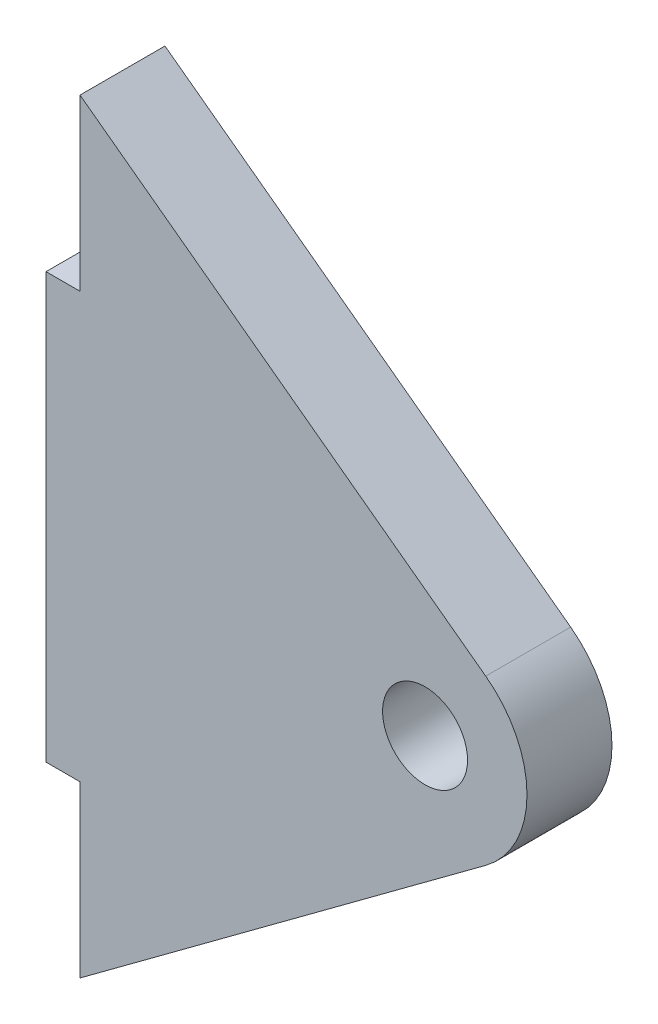
ISO-10303-21;
HEADER;
FILE_DESCRIPTION(('STEP AP214'),'2;1');
FILE_NAME('part.step','',(''),(''),'','','');
FILE_SCHEMA(('AUTOMOTIVE_DESIGN { 1 0 10303 214 1 1 1 1 }'));
ENDSEC;
DATA;
#1=APPLICATION_CONTEXT('core data for automotive mechanical design processes');
#2=APPLICATION_PROTOCOL_DEFINITION('international standard','automotive_design',2000,#1);
#3=PRODUCT_CONTEXT('',#1,'mechanical');
#4=PRODUCT('Part','Part','',(#3));
#5=PRODUCT_RELATED_PRODUCT_CATEGORY('part','',(#4));
#6=PRODUCT_DEFINITION_FORMATION('','',#4);
#7=PRODUCT_DEFINITION_CONTEXT('part definition',#1,'design');
#8=PRODUCT_DEFINITION('design','',#6,#7);
#9=PRODUCT_DEFINITION_SHAPE('','',#8);
#10=(LENGTH_UNIT() NAMED_UNIT(*) SI_UNIT(.MILLI.,.METRE.));
#11=(NAMED_UNIT(*) PLANE_ANGLE_UNIT() SI_UNIT($,.RADIAN.));
#12=(NAMED_UNIT(*) SI_UNIT($,.STERADIAN.) SOLID_ANGLE_UNIT());
#13=UNCERTAINTY_MEASURE_WITH_UNIT(LENGTH_MEASURE(1.E-05),#10,'distance_accuracy_value','');
#14=(GEOMETRIC_REPRESENTATION_CONTEXT(3) GLOBAL_UNCERTAINTY_ASSIGNED_CONTEXT((#13)) GLOBAL_UNIT_ASSIGNED_CONTEXT((#10,
#11,#12)) REPRESENTATION_CONTEXT('',''));
#15=CARTESIAN_POINT('',(0.,0.,0.));
#16=DIRECTION('',(0.,0.,1.));
#17=DIRECTION('',(1.,0.,0.));
#18=AXIS2_PLACEMENT_3D('',#15,#16,#17);
#19=CARTESIAN_POINT('',(210.781303050667,212.057553234732,5.));
#20=DIRECTION('',(0.,0.,-1.));
#21=DIRECTION('',(-1.,0.,0.));
#22=AXIS2_PLACEMENT_3D('',#19,#20,#21);
#23=CYLINDRICAL_SURFACE('',#22,6.);
#24=CARTESIAN_POINT('',(210.781303050667,212.057553234732,0.));
#25=DIRECTION('',(0.,0.,1.));
#26=DIRECTION('',(1.,0.,0.));
#27=AXIS2_PLACEMENT_3D('',#24,#25,#26);
#28=CIRCLE('',#27,6.);
#29=CARTESIAN_POINT('',(214.351594971474,216.879691308265,0.));
#30=VERTEX_POINT('',#29);
#31=CARTESIAN_POINT('',(214.351594971474,207.235415161199,0.));
#32=VERTEX_POINT('',#31);
#33=EDGE_CURVE('E170',#30,#32,#28,.F.);
#34=ORIENTED_EDGE('',*,*,#33,.F.);
#35=DIRECTION('',(0.,0.,-1.));
#36=VECTOR('',#35,1.);
#37=CARTESIAN_POINT('',(214.351594971474,216.879691308265,5.));
#38=LINE('',#37,#36);
#39=CARTESIAN_POINT('',(214.351594971474,216.879691308265,5.));
#40=VERTEX_POINT('',#39);
#41=EDGE_CURVE('E11',#40,#30,#38,.T.);
#42=ORIENTED_EDGE('',*,*,#41,.F.);
#43=CARTESIAN_POINT('',(210.781303050667,212.057553234732,5.));
#44=DIRECTION('',(0.,0.,1.));
#45=DIRECTION('',(1.,0.,0.));
#46=AXIS2_PLACEMENT_3D('',#43,#44,#45);
#47=CIRCLE('',#46,6.);
#48=CARTESIAN_POINT('',(214.351594971474,207.235415161199,5.));
#49=VERTEX_POINT('',#48);
#50=EDGE_CURVE('E139',#40,#49,#47,.F.);
#51=ORIENTED_EDGE('',*,*,#50,.T.);
#52=DIRECTION('',(0.,0.,-1.));
#53=VECTOR('',#52,1.);
#54=CARTESIAN_POINT('',(214.351594971474,207.235415161199,5.));
#55=LINE('',#54,#53);
#56=EDGE_CURVE('E53',#49,#32,#55,.T.);
#57=ORIENTED_EDGE('',*,*,#56,.T.);
#58=EDGE_LOOP('',(#34,#42,#51,#57));
#59=FACE_BOUND('',#58,.T.);
#60=ADVANCED_FACE('F37',(#59),#23,.T.);
#61=CARTESIAN_POINT('',(179.617576694411,242.596620799026,5.));
#62=DIRECTION('',(0.595048653467869,0.803689678922204,0.));
#63=DIRECTION('',(-0.803689678922204,0.595048653467869,0.));
#64=AXIS2_PLACEMENT_3D('',#61,#62,#63);
#65=PLANE('',#64);
#66=DIRECTION('',(0.803689678922204,-0.595048653467869,0.));
#67=VECTOR('',#66,1.);
#68=CARTESIAN_POINT('',(179.617576694411,242.596620799026,0.));
#69=LINE('',#68,#67);
#70=CARTESIAN_POINT('',(190.475370577193,234.557553234732,0.));
#71=VERTEX_POINT('',#70);
#72=EDGE_CURVE('E167',#71,#30,#69,.T.);
#73=ORIENTED_EDGE('',*,*,#72,.F.);
#74=DIRECTION('',(0.,0.,-1.));
#75=VECTOR('',#74,1.);
#76=CARTESIAN_POINT('',(190.475370577193,234.557553234732,5.));
#77=LINE('',#76,#75);
#78=CARTESIAN_POINT('',(190.475370577193,234.557553234732,5.));
#79=VERTEX_POINT('',#78);
#80=EDGE_CURVE('E45',#79,#71,#77,.T.);
#81=ORIENTED_EDGE('',*,*,#80,.F.);
#82=DIRECTION('',(0.803689678922204,-0.595048653467869,0.));
#83=VECTOR('',#82,1.);
#84=CARTESIAN_POINT('',(179.617576694411,242.596620799026,5.));
#85=LINE('',#84,#83);
#86=EDGE_CURVE('E135',#79,#40,#85,.T.);
#87=ORIENTED_EDGE('',*,*,#86,.T.);
#88=ORIENTED_EDGE('',*,*,#41,.T.);
#89=EDGE_LOOP('',(#73,#81,#87,#88));
#90=FACE_BOUND('',#89,.T.);
#91=ADVANCED_FACE('F168',(#90),#65,.T.);
#92=CARTESIAN_POINT('',(190.475370577193,0.,5.));
#93=DIRECTION('',(-1.,0.,0.));
#94=DIRECTION('',(0.,0.,1.));
#95=AXIS2_PLACEMENT_3D('',#92,#93,#94);
#96=PLANE('',#95);
#97=DIRECTION('',(0.,1.,0.));
#98=VECTOR('',#97,1.);
#99=CARTESIAN_POINT('',(190.475370577193,0.,0.));
#100=LINE('',#99,#98);
#101=CARTESIAN_POINT('',(190.475370577193,224.557553234732,0.));
#102=VERTEX_POINT('',#101);
#103=EDGE_CURVE('E165',#102,#71,#100,.T.);
#104=ORIENTED_EDGE('',*,*,#103,.F.);
#105=DIRECTION('',(0.,0.,-1.));
#106=VECTOR('',#105,1.);
#107=CARTESIAN_POINT('',(190.475370577193,224.557553234732,5.));
#108=LINE('',#107,#106);
#109=CARTESIAN_POINT('',(190.475370577193,224.557553234732,5.));
#110=VERTEX_POINT('',#109);
#111=EDGE_CURVE('E160',#110,#102,#108,.T.);
#112=ORIENTED_EDGE('',*,*,#111,.F.);
#113=DIRECTION('',(0.,1.,0.));
#114=VECTOR('',#113,1.);
#115=CARTESIAN_POINT('',(190.475370577193,0.,5.));
#116=LINE('',#115,#114);
#117=EDGE_CURVE('E128',#110,#79,#116,.T.);
#118=ORIENTED_EDGE('',*,*,#117,.T.);
#119=ORIENTED_EDGE('',*,*,#80,.T.);
#120=EDGE_LOOP('',(#104,#112,#118,#119));
#121=FACE_BOUND('',#120,.T.);
#122=ADVANCED_FACE('F163',(#121),#96,.T.);
#123=CARTESIAN_POINT('',(0.,224.557553234732,5.));
#124=DIRECTION('',(0.,-1.,0.));
#125=DIRECTION('',(0.,0.,-1.));
#126=AXIS2_PLACEMENT_3D('',#123,#124,#125);
#127=PLANE('',#126);
#128=DIRECTION('',(-1.,0.,0.));
#129=VECTOR('',#128,1.);
#130=CARTESIAN_POINT('',(0.,224.557553234732,0.));
#131=LINE('',#130,#129);
#132=CARTESIAN_POINT('',(188.475370577193,224.557553234732,0.));
#133=VERTEX_POINT('',#132);
#134=EDGE_CURVE('E175',#102,#133,#131,.T.);
#135=ORIENTED_EDGE('',*,*,#134,.T.);
#136=DIRECTION('',(0.,0.,-1.));
#137=VECTOR('',#136,1.);
#138=CARTESIAN_POINT('',(188.475370577193,224.557553234732,5.));
#139=LINE('',#138,#137);
#140=CARTESIAN_POINT('',(188.475370577193,224.557553234732,5.));
#141=VERTEX_POINT('',#140);
#142=EDGE_CURVE('E157',#141,#133,#139,.T.);
#143=ORIENTED_EDGE('',*,*,#142,.F.);
#144=DIRECTION('',(-1.,0.,0.));
#145=VECTOR('',#144,1.);
#146=CARTESIAN_POINT('',(0.,224.557553234732,5.));
#147=LINE('',#146,#145);
#148=EDGE_CURVE('E134',#110,#141,#147,.T.);
#149=ORIENTED_EDGE('',*,*,#148,.F.);
#150=ORIENTED_EDGE('',*,*,#111,.T.);
#151=EDGE_LOOP('',(#135,#143,#149,#150));
#152=FACE_BOUND('',#151,.T.);
#153=ADVANCED_FACE('F185',(#152),#127,.F.);
#154=CARTESIAN_POINT('',(188.475370577193,0.,5.));
#155=DIRECTION('',(1.,0.,0.));
#156=DIRECTION('',(0.,0.,-1.));
#157=AXIS2_PLACEMENT_3D('',#154,#155,#156);
#158=PLANE('',#157);
#159=DIRECTION('',(0.,-1.,0.));
#160=VECTOR('',#159,1.);
#161=CARTESIAN_POINT('',(188.475370577193,0.,0.));
#162=LINE('',#161,#160);
#163=CARTESIAN_POINT('',(188.475370577193,199.557553234732,0.));
#164=VERTEX_POINT('',#163);
#165=EDGE_CURVE('E177',#133,#164,#162,.T.);
#166=ORIENTED_EDGE('',*,*,#165,.T.);
#167=DIRECTION('',(0.,0.,-1.));
#168=VECTOR('',#167,1.);
#169=CARTESIAN_POINT('',(188.475370577193,199.557553234732,5.));
#170=LINE('',#169,#168);
#171=CARTESIAN_POINT('',(188.475370577193,199.557553234732,5.));
#172=VERTEX_POINT('',#171);
#173=EDGE_CURVE('E123',#172,#164,#170,.T.);
#174=ORIENTED_EDGE('',*,*,#173,.F.);
#175=DIRECTION('',(0.,-1.,0.));
#176=VECTOR('',#175,1.);
#177=CARTESIAN_POINT('',(188.475370577193,0.,5.));
#178=LINE('',#177,#176);
#179=EDGE_CURVE('E111',#141,#172,#178,.T.);
#180=ORIENTED_EDGE('',*,*,#179,.F.);
#181=ORIENTED_EDGE('',*,*,#142,.T.);
#182=EDGE_LOOP('',(#166,#174,#180,#181));
#183=FACE_BOUND('',#182,.T.);
#184=ADVANCED_FACE('F181',(#183),#158,.F.);
#185=CARTESIAN_POINT('',(0.,199.557553234732,5.));
#186=DIRECTION('',(0.,1.,0.));
#187=DIRECTION('',(0.,0.,1.));
#188=AXIS2_PLACEMENT_3D('',#185,#186,#187);
#189=PLANE('',#188);
#190=DIRECTION('',(1.,0.,0.));
#191=VECTOR('',#190,1.);
#192=CARTESIAN_POINT('',(0.,199.557553234732,0.));
#193=LINE('',#192,#191);
#194=CARTESIAN_POINT('',(190.475370577193,199.557553234732,0.));
#195=VERTEX_POINT('',#194);
#196=EDGE_CURVE('E120',#164,#195,#193,.T.);
#197=ORIENTED_EDGE('',*,*,#196,.T.);
#198=DIRECTION('',(0.,0.,-1.));
#199=VECTOR('',#198,1.);
#200=CARTESIAN_POINT('',(190.475370577193,199.557553234732,5.));
#201=LINE('',#200,#199);
#202=CARTESIAN_POINT('',(190.475370577193,199.557553234732,5.));
#203=VERTEX_POINT('',#202);
#204=EDGE_CURVE('E117',#203,#195,#201,.T.);
#205=ORIENTED_EDGE('',*,*,#204,.F.);
#206=DIRECTION('',(1.,0.,0.));
#207=VECTOR('',#206,1.);
#208=CARTESIAN_POINT('',(0.,199.557553234732,5.));
#209=LINE('',#208,#207);
#210=EDGE_CURVE('E103',#172,#203,#209,.T.);
#211=ORIENTED_EDGE('',*,*,#210,.F.);
#212=ORIENTED_EDGE('',*,*,#173,.T.);
#213=EDGE_LOOP('',(#197,#205,#211,#212));
#214=FACE_BOUND('',#213,.T.);
#215=ADVANCED_FACE('F118',(#214),#189,.F.);
#216=CARTESIAN_POINT('',(190.475370577193,189.557553234732,0.));
#217=VERTEX_POINT('',#216);
#218=EDGE_CURVE('E150',#217,#195,#100,.T.);
#219=ORIENTED_EDGE('',*,*,#218,.F.);
#220=DIRECTION('',(0.,0.,-1.));
#221=VECTOR('',#220,1.);
#222=CARTESIAN_POINT('',(190.475370577193,189.557553234732,5.));
#223=LINE('',#222,#221);
#224=CARTESIAN_POINT('',(190.475370577193,189.557553234732,5.));
#225=VERTEX_POINT('',#224);
#226=EDGE_CURVE('E78',#225,#217,#223,.T.);
#227=ORIENTED_EDGE('',*,*,#226,.F.);
#228=EDGE_CURVE('E109',#225,#203,#116,.T.);
#229=ORIENTED_EDGE('',*,*,#228,.T.);
#230=ORIENTED_EDGE('',*,*,#204,.T.);
#231=EDGE_LOOP('',(#219,#227,#229,#230));
#232=FACE_BOUND('',#231,.T.);
#233=ADVANCED_FACE('F125',(#232),#96,.T.);
#234=CARTESIAN_POINT('',(-23.2088827554402,31.3465788404982,5.));
#235=DIRECTION('',(0.595048653467869,-0.803689678922204,0.));
#236=DIRECTION('',(0.803689678922204,0.595048653467869,0.));
#237=AXIS2_PLACEMENT_3D('',#234,#235,#236);
#238=PLANE('',#237);
#239=DIRECTION('',(-0.803689678922204,-0.595048653467869,0.));
#240=VECTOR('',#239,1.);
#241=CARTESIAN_POINT('',(-23.2088827554402,31.3465788404982,0.));
#242=LINE('',#241,#240);
#243=EDGE_CURVE('E145',#32,#217,#242,.T.);
#244=ORIENTED_EDGE('',*,*,#243,.F.);
#245=ORIENTED_EDGE('',*,*,#56,.F.);
#246=DIRECTION('',(-0.803689678922204,-0.595048653467869,0.));
#247=VECTOR('',#246,1.);
#248=CARTESIAN_POINT('',(-23.2088827554402,31.3465788404982,5.));
#249=LINE('',#248,#247);
#250=EDGE_CURVE('E126',#49,#225,#249,.T.);
#251=ORIENTED_EDGE('',*,*,#250,.T.);
#252=ORIENTED_EDGE('',*,*,#226,.T.);
#253=EDGE_LOOP('',(#244,#245,#251,#252));
#254=FACE_BOUND('',#253,.T.);
#255=ADVANCED_FACE('F186',(#254),#238,.T.);
#256=CARTESIAN_POINT('',(210.781303050667,212.057553234732,5.));
#257=DIRECTION('',(0.,0.,-1.));
#258=DIRECTION('',(-1.,0.,0.));
#259=AXIS2_PLACEMENT_3D('',#256,#257,#258);
#260=CYLINDRICAL_SURFACE('',#259,2.5);
#261=CARTESIAN_POINT('',(210.781303050667,212.057553234732,5.));
#262=DIRECTION('',(0.,0.,1.));
#263=DIRECTION('',(1.,0.,0.));
#264=AXIS2_PLACEMENT_3D('',#261,#262,#263);
#265=CIRCLE('',#264,2.5);
#266=CARTESIAN_POINT('',(213.281303050667,212.057553234732,5.));
#267=VERTEX_POINT('',#266);
#268=EDGE_CURVE('E129',#267,#267,#265,.T.);
#269=ORIENTED_EDGE('',*,*,#268,.T.);
#270=EDGE_LOOP('',(#269));
#271=FACE_BOUND('',#270,.T.);
#272=CARTESIAN_POINT('',(210.781303050667,212.057553234732,0.));
#273=DIRECTION('',(0.,0.,1.));
#274=DIRECTION('',(1.,0.,0.));
#275=AXIS2_PLACEMENT_3D('',#272,#273,#274);
#276=CIRCLE('',#275,2.5);
#277=CARTESIAN_POINT('',(213.281303050667,212.057553234732,0.));
#278=VERTEX_POINT('',#277);
#279=EDGE_CURVE('E142',#278,#278,#276,.T.);
#280=ORIENTED_EDGE('',*,*,#279,.F.);
#281=EDGE_LOOP('',(#280));
#282=FACE_BOUND('',#281,.T.);
#283=ADVANCED_FACE('F188',(#271,#282),#260,.F.);
#284=CARTESIAN_POINT('',(0.,0.,5.));
#285=DIRECTION('',(0.,0.,1.));
#286=DIRECTION('',(1.,0.,0.));
#287=AXIS2_PLACEMENT_3D('',#284,#285,#286);
#288=PLANE('',#287);
#289=ORIENTED_EDGE('',*,*,#50,.F.);
#290=ORIENTED_EDGE('',*,*,#86,.F.);
#291=ORIENTED_EDGE('',*,*,#117,.F.);
#292=ORIENTED_EDGE('',*,*,#148,.T.);
#293=ORIENTED_EDGE('',*,*,#179,.T.);
#294=ORIENTED_EDGE('',*,*,#210,.T.);
#295=ORIENTED_EDGE('',*,*,#228,.F.);
#296=ORIENTED_EDGE('',*,*,#250,.F.);
#297=EDGE_LOOP('',(#289,#290,#291,#292,#293,#294,#295,#296));
#298=FACE_BOUND('',#297,.T.);
#299=ORIENTED_EDGE('',*,*,#268,.F.);
#300=EDGE_LOOP('',(#299));
#301=FACE_BOUND('',#300,.T.);
#302=ADVANCED_FACE('F105',(#298,#301),#288,.T.);
#303=CARTESIAN_POINT('',(0.,0.,0.));
#304=DIRECTION('',(0.,0.,1.));
#305=DIRECTION('',(1.,0.,0.));
#306=AXIS2_PLACEMENT_3D('',#303,#304,#305);
#307=PLANE('',#306);
#308=ORIENTED_EDGE('',*,*,#33,.T.);
#309=ORIENTED_EDGE('',*,*,#243,.T.);
#310=ORIENTED_EDGE('',*,*,#218,.T.);
#311=ORIENTED_EDGE('',*,*,#196,.F.);
#312=ORIENTED_EDGE('',*,*,#165,.F.);
#313=ORIENTED_EDGE('',*,*,#134,.F.);
#314=ORIENTED_EDGE('',*,*,#103,.T.);
#315=ORIENTED_EDGE('',*,*,#72,.T.);
#316=EDGE_LOOP('',(#308,#309,#310,#311,#312,#313,#314,#315));
#317=FACE_BOUND('',#316,.T.);
#318=ORIENTED_EDGE('',*,*,#279,.T.);
#319=EDGE_LOOP('',(#318));
#320=FACE_BOUND('',#319,.T.);
#321=ADVANCED_FACE('F173',(#317,#320),#307,.F.);
#322=CLOSED_SHELL('',(#60,#91,#122,#153,#184,#215,#233,#255,#283,#302,#321));
#323=MANIFOLD_SOLID_BREP('B2',#322);
#324=ADVANCED_BREP_SHAPE_REPRESENTATION('',(#18,#323),#14);
#325=SHAPE_DEFINITION_REPRESENTATION(#9,#324);
ENDSEC;
END-ISO-10303-21;
